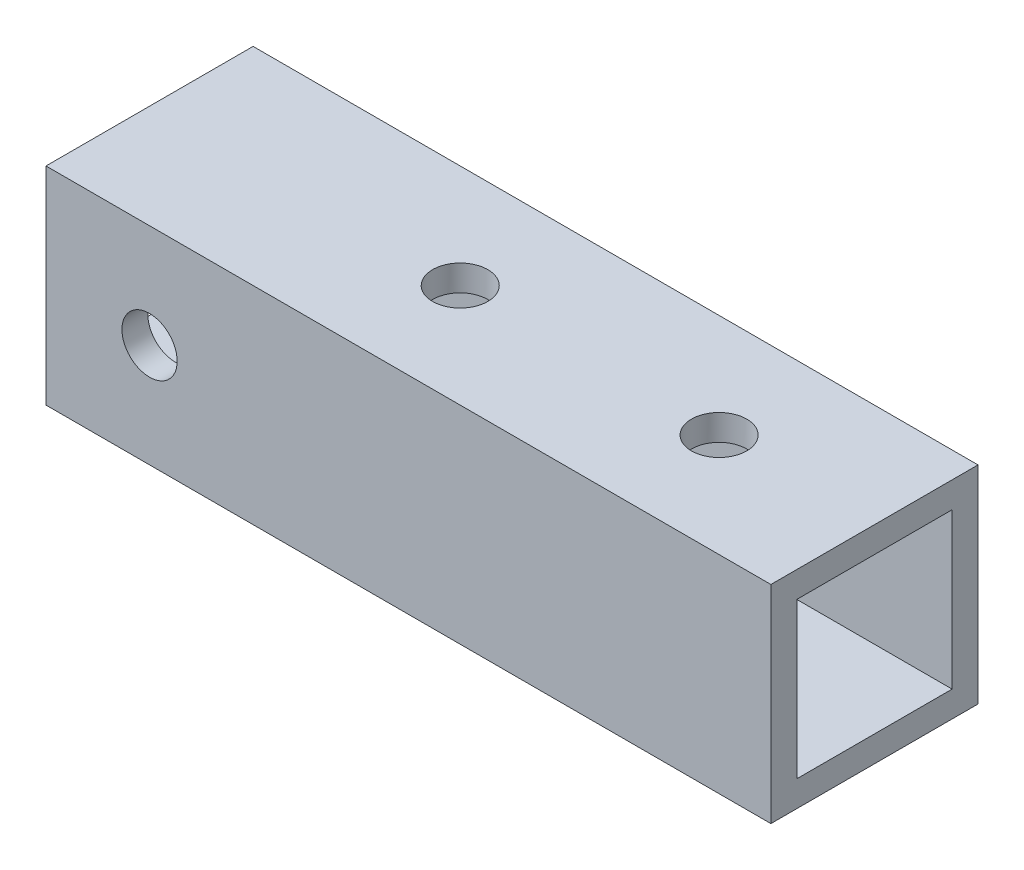
ISO-10303-21;
HEADER;
FILE_DESCRIPTION(('STEP AP214'),'2;1');
FILE_NAME('part.step','',(''),(''),'','','');
FILE_SCHEMA(('AUTOMOTIVE_DESIGN { 1 0 10303 214 1 1 1 1 }'));
ENDSEC;
DATA;
#1=APPLICATION_CONTEXT('core data for automotive mechanical design processes');
#2=APPLICATION_PROTOCOL_DEFINITION('international standard','automotive_design',2000,#1);
#3=PRODUCT_CONTEXT('',#1,'mechanical');
#4=PRODUCT('Part','Part','',(#3));
#5=PRODUCT_RELATED_PRODUCT_CATEGORY('part','',(#4));
#6=PRODUCT_DEFINITION_FORMATION('','',#4);
#7=PRODUCT_DEFINITION_CONTEXT('part definition',#1,'design');
#8=PRODUCT_DEFINITION('design','',#6,#7);
#9=PRODUCT_DEFINITION_SHAPE('','',#8);
#10=(LENGTH_UNIT() NAMED_UNIT(*) SI_UNIT(.MILLI.,.METRE.));
#11=(NAMED_UNIT(*) PLANE_ANGLE_UNIT() SI_UNIT($,.RADIAN.));
#12=(NAMED_UNIT(*) SI_UNIT($,.STERADIAN.) SOLID_ANGLE_UNIT());
#13=UNCERTAINTY_MEASURE_WITH_UNIT(LENGTH_MEASURE(1.E-05),#10,'distance_accuracy_value','');
#14=(GEOMETRIC_REPRESENTATION_CONTEXT(3) GLOBAL_UNCERTAINTY_ASSIGNED_CONTEXT((#13)) GLOBAL_UNIT_ASSIGNED_CONTEXT((#10,
#11,#12)) REPRESENTATION_CONTEXT('',''));
#15=CARTESIAN_POINT('',(0.,0.,0.));
#16=DIRECTION('',(0.,0.,1.));
#17=DIRECTION('',(1.,0.,0.));
#18=AXIS2_PLACEMENT_3D('',#15,#16,#17);
#19=CARTESIAN_POINT('',(21.,0.,0.));
#20=DIRECTION('',(-1.,0.,0.));
#21=DIRECTION('',(0.,0.,1.));
#22=AXIS2_PLACEMENT_3D('',#19,#20,#21);
#23=PLANE('',#22);
#24=DIRECTION('',(0.,-1.,0.));
#25=VECTOR('',#24,1.);
#26=CARTESIAN_POINT('',(21.,6.,6.));
#27=LINE('',#26,#25);
#28=CARTESIAN_POINT('',(21.,6.,6.));
#29=VERTEX_POINT('',#28);
#30=CARTESIAN_POINT('',(21.,-6.,6.));
#31=VERTEX_POINT('',#30);
#32=EDGE_CURVE('E144',#29,#31,#27,.T.);
#33=ORIENTED_EDGE('',*,*,#32,.T.);
#34=DIRECTION('',(0.,0.,-1.));
#35=VECTOR('',#34,1.);
#36=CARTESIAN_POINT('',(21.,-6.,-6.));
#37=LINE('',#36,#35);
#38=CARTESIAN_POINT('',(21.,-6.,-6.));
#39=VERTEX_POINT('',#38);
#40=EDGE_CURVE('E147',#31,#39,#37,.T.);
#41=ORIENTED_EDGE('',*,*,#40,.T.);
#42=DIRECTION('',(0.,1.,0.));
#43=VECTOR('',#42,1.);
#44=CARTESIAN_POINT('',(21.,6.,-6.));
#45=LINE('',#44,#43);
#46=CARTESIAN_POINT('',(21.,6.,-6.));
#47=VERTEX_POINT('',#46);
#48=EDGE_CURVE('E150',#39,#47,#45,.T.);
#49=ORIENTED_EDGE('',*,*,#48,.T.);
#50=DIRECTION('',(0.,0.,1.));
#51=VECTOR('',#50,1.);
#52=CARTESIAN_POINT('',(21.,6.,-6.));
#53=LINE('',#52,#51);
#54=EDGE_CURVE('E152',#47,#29,#53,.T.);
#55=ORIENTED_EDGE('',*,*,#54,.T.);
#56=EDGE_LOOP('',(#33,#41,#49,#55));
#57=FACE_BOUND('',#56,.T.);
#58=DIRECTION('',(0.,0.,1.));
#59=VECTOR('',#58,1.);
#60=CARTESIAN_POINT('',(21.,4.5,-4.5));
#61=LINE('',#60,#59);
#62=CARTESIAN_POINT('',(21.,4.5,-4.5));
#63=VERTEX_POINT('',#62);
#64=CARTESIAN_POINT('',(21.,4.5,4.5));
#65=VERTEX_POINT('',#64);
#66=EDGE_CURVE('E106',#63,#65,#61,.T.);
#67=ORIENTED_EDGE('',*,*,#66,.F.);
#68=DIRECTION('',(0.,1.,0.));
#69=VECTOR('',#68,1.);
#70=CARTESIAN_POINT('',(21.,4.5,-4.5));
#71=LINE('',#70,#69);
#72=CARTESIAN_POINT('',(21.,-4.5,-4.5));
#73=VERTEX_POINT('',#72);
#74=EDGE_CURVE('E128',#73,#63,#71,.T.);
#75=ORIENTED_EDGE('',*,*,#74,.F.);
#76=DIRECTION('',(0.,0.,-1.));
#77=VECTOR('',#76,1.);
#78=CARTESIAN_POINT('',(21.,-4.5,-4.5));
#79=LINE('',#78,#77);
#80=CARTESIAN_POINT('',(21.,-4.5,4.5));
#81=VERTEX_POINT('',#80);
#82=EDGE_CURVE('E126',#81,#73,#79,.T.);
#83=ORIENTED_EDGE('',*,*,#82,.F.);
#84=DIRECTION('',(0.,-1.,0.));
#85=VECTOR('',#84,1.);
#86=CARTESIAN_POINT('',(21.,4.5,4.5));
#87=LINE('',#86,#85);
#88=EDGE_CURVE('E114',#65,#81,#87,.T.);
#89=ORIENTED_EDGE('',*,*,#88,.F.);
#90=EDGE_LOOP('',(#67,#75,#83,#89));
#91=FACE_BOUND('',#90,.T.);
#92=ADVANCED_FACE('F39',(#57,#91),#23,.F.);
#93=CARTESIAN_POINT('',(-21.,0.,0.));
#94=DIRECTION('',(-1.,0.,0.));
#95=DIRECTION('',(0.,0.,1.));
#96=AXIS2_PLACEMENT_3D('',#93,#94,#95);
#97=PLANE('',#96);
#98=DIRECTION('',(0.,-1.,0.));
#99=VECTOR('',#98,1.);
#100=CARTESIAN_POINT('',(-21.,6.,6.));
#101=LINE('',#100,#99);
#102=CARTESIAN_POINT('',(-21.,6.,6.));
#103=VERTEX_POINT('',#102);
#104=CARTESIAN_POINT('',(-21.,-6.,6.));
#105=VERTEX_POINT('',#104);
#106=EDGE_CURVE('E122',#103,#105,#101,.T.);
#107=ORIENTED_EDGE('',*,*,#106,.F.);
#108=DIRECTION('',(0.,0.,1.));
#109=VECTOR('',#108,1.);
#110=CARTESIAN_POINT('',(-21.,6.,-6.));
#111=LINE('',#110,#109);
#112=CARTESIAN_POINT('',(-21.,6.,-6.));
#113=VERTEX_POINT('',#112);
#114=EDGE_CURVE('E148',#113,#103,#111,.T.);
#115=ORIENTED_EDGE('',*,*,#114,.F.);
#116=DIRECTION('',(0.,1.,0.));
#117=VECTOR('',#116,1.);
#118=CARTESIAN_POINT('',(-21.,6.,-6.));
#119=LINE('',#118,#117);
#120=CARTESIAN_POINT('',(-21.,-6.,-6.));
#121=VERTEX_POINT('',#120);
#122=EDGE_CURVE('E159',#121,#113,#119,.T.);
#123=ORIENTED_EDGE('',*,*,#122,.F.);
#124=DIRECTION('',(0.,0.,-1.));
#125=VECTOR('',#124,1.);
#126=CARTESIAN_POINT('',(-21.,-6.,-6.));
#127=LINE('',#126,#125);
#128=EDGE_CURVE('E157',#105,#121,#127,.T.);
#129=ORIENTED_EDGE('',*,*,#128,.F.);
#130=EDGE_LOOP('',(#107,#115,#123,#129));
#131=FACE_BOUND('',#130,.T.);
#132=DIRECTION('',(0.,1.,0.));
#133=VECTOR('',#132,1.);
#134=CARTESIAN_POINT('',(-21.,4.5,-4.5));
#135=LINE('',#134,#133);
#136=CARTESIAN_POINT('',(-21.,-4.5,-4.5));
#137=VERTEX_POINT('',#136);
#138=CARTESIAN_POINT('',(-21.,4.5,-4.5));
#139=VERTEX_POINT('',#138);
#140=EDGE_CURVE('E115',#137,#139,#135,.T.);
#141=ORIENTED_EDGE('',*,*,#140,.T.);
#142=DIRECTION('',(0.,0.,1.));
#143=VECTOR('',#142,1.);
#144=CARTESIAN_POINT('',(-21.,4.5,-4.5));
#145=LINE('',#144,#143);
#146=CARTESIAN_POINT('',(-21.,4.5,4.5));
#147=VERTEX_POINT('',#146);
#148=EDGE_CURVE('E64',#139,#147,#145,.T.);
#149=ORIENTED_EDGE('',*,*,#148,.T.);
#150=DIRECTION('',(0.,-1.,0.));
#151=VECTOR('',#150,1.);
#152=CARTESIAN_POINT('',(-21.,4.5,4.5));
#153=LINE('',#152,#151);
#154=CARTESIAN_POINT('',(-21.,-4.5,4.5));
#155=VERTEX_POINT('',#154);
#156=EDGE_CURVE('E121',#147,#155,#153,.T.);
#157=ORIENTED_EDGE('',*,*,#156,.T.);
#158=DIRECTION('',(0.,0.,-1.));
#159=VECTOR('',#158,1.);
#160=CARTESIAN_POINT('',(-21.,-4.5,-4.5));
#161=LINE('',#160,#159);
#162=EDGE_CURVE('E136',#155,#137,#161,.T.);
#163=ORIENTED_EDGE('',*,*,#162,.T.);
#164=EDGE_LOOP('',(#141,#149,#157,#163));
#165=FACE_BOUND('',#164,.T.);
#166=ADVANCED_FACE('F217',(#131,#165),#97,.T.);
#167=CARTESIAN_POINT('',(21.,6.,6.));
#168=DIRECTION('',(0.,0.,-1.));
#169=DIRECTION('',(0.,1.,0.));
#170=AXIS2_PLACEMENT_3D('',#167,#168,#169);
#171=PLANE('',#170);
#172=CARTESIAN_POINT('',(-15.,0.,6.));
#173=DIRECTION('',(0.,0.,1.));
#174=DIRECTION('',(1.,0.,0.));
#175=AXIS2_PLACEMENT_3D('',#172,#173,#174);
#176=CIRCLE('',#175,1.60000000000002);
#177=CARTESIAN_POINT('',(-13.4,0.,6.));
#178=VERTEX_POINT('',#177);
#179=EDGE_CURVE('E197',#178,#178,#176,.T.);
#180=ORIENTED_EDGE('',*,*,#179,.F.);
#181=EDGE_LOOP('',(#180));
#182=FACE_BOUND('',#181,.T.);
#183=ORIENTED_EDGE('',*,*,#106,.T.);
#184=DIRECTION('',(-1.,0.,0.));
#185=VECTOR('',#184,1.);
#186=CARTESIAN_POINT('',(21.,-6.,6.));
#187=LINE('',#186,#185);
#188=EDGE_CURVE('E11',#31,#105,#187,.T.);
#189=ORIENTED_EDGE('',*,*,#188,.F.);
#190=ORIENTED_EDGE('',*,*,#32,.F.);
#191=DIRECTION('',(-1.,0.,0.));
#192=VECTOR('',#191,1.);
#193=CARTESIAN_POINT('',(21.,6.,6.));
#194=LINE('',#193,#192);
#195=EDGE_CURVE('E154',#29,#103,#194,.T.);
#196=ORIENTED_EDGE('',*,*,#195,.T.);
#197=EDGE_LOOP('',(#183,#189,#190,#196));
#198=FACE_BOUND('',#197,.T.);
#199=ADVANCED_FACE('F41',(#182,#198),#171,.F.);
#200=CARTESIAN_POINT('',(21.,-6.,-6.));
#201=DIRECTION('',(0.,1.,0.));
#202=DIRECTION('',(0.,0.,1.));
#203=AXIS2_PLACEMENT_3D('',#200,#201,#202);
#204=PLANE('',#203);
#205=CARTESIAN_POINT('',(-3.,-6.,0.));
#206=DIRECTION('',(0.,1.,0.));
#207=DIRECTION('',(0.,0.,1.));
#208=AXIS2_PLACEMENT_3D('',#205,#206,#207);
#209=CIRCLE('',#208,1.60000000000002);
#210=CARTESIAN_POINT('',(-3.,-6.,1.60000000000002));
#211=VERTEX_POINT('',#210);
#212=EDGE_CURVE('E172',#211,#211,#209,.T.);
#213=ORIENTED_EDGE('',*,*,#212,.T.);
#214=EDGE_LOOP('',(#213));
#215=FACE_BOUND('',#214,.T.);
#216=CARTESIAN_POINT('',(12.,-6.,0.));
#217=DIRECTION('',(0.,1.,0.));
#218=DIRECTION('',(0.,0.,1.));
#219=AXIS2_PLACEMENT_3D('',#216,#217,#218);
#220=CIRCLE('',#219,1.60000000000002);
#221=CARTESIAN_POINT('',(12.,-6.,1.60000000000002));
#222=VERTEX_POINT('',#221);
#223=EDGE_CURVE('E186',#222,#222,#220,.T.);
#224=ORIENTED_EDGE('',*,*,#223,.T.);
#225=EDGE_LOOP('',(#224));
#226=FACE_BOUND('',#225,.T.);
#227=ORIENTED_EDGE('',*,*,#128,.T.);
#228=DIRECTION('',(-1.,0.,0.));
#229=VECTOR('',#228,1.);
#230=CARTESIAN_POINT('',(21.,-6.,-6.));
#231=LINE('',#230,#229);
#232=EDGE_CURVE('E48',#39,#121,#231,.T.);
#233=ORIENTED_EDGE('',*,*,#232,.F.);
#234=ORIENTED_EDGE('',*,*,#40,.F.);
#235=ORIENTED_EDGE('',*,*,#188,.T.);
#236=EDGE_LOOP('',(#227,#233,#234,#235));
#237=FACE_BOUND('',#236,.T.);
#238=ADVANCED_FACE('F244',(#215,#226,#237),#204,.F.);
#239=CARTESIAN_POINT('',(21.,6.,-6.));
#240=DIRECTION('',(0.,0.,1.));
#241=DIRECTION('',(0.,-1.,0.));
#242=AXIS2_PLACEMENT_3D('',#239,#240,#241);
#243=PLANE('',#242);
#244=CARTESIAN_POINT('',(-15.,0.,-6.));
#245=DIRECTION('',(0.,0.,1.));
#246=DIRECTION('',(1.,0.,0.));
#247=AXIS2_PLACEMENT_3D('',#244,#245,#246);
#248=CIRCLE('',#247,1.60000000000002);
#249=CARTESIAN_POINT('',(-13.4,0.,-6.));
#250=VERTEX_POINT('',#249);
#251=EDGE_CURVE('E200',#250,#250,#248,.T.);
#252=ORIENTED_EDGE('',*,*,#251,.T.);
#253=EDGE_LOOP('',(#252));
#254=FACE_BOUND('',#253,.T.);
#255=ORIENTED_EDGE('',*,*,#122,.T.);
#256=DIRECTION('',(-1.,0.,0.));
#257=VECTOR('',#256,1.);
#258=CARTESIAN_POINT('',(21.,6.,-6.));
#259=LINE('',#258,#257);
#260=EDGE_CURVE('E164',#47,#113,#259,.T.);
#261=ORIENTED_EDGE('',*,*,#260,.F.);
#262=ORIENTED_EDGE('',*,*,#48,.F.);
#263=ORIENTED_EDGE('',*,*,#232,.T.);
#264=EDGE_LOOP('',(#255,#261,#262,#263));
#265=FACE_BOUND('',#264,.T.);
#266=ADVANCED_FACE('F241',(#254,#265),#243,.F.);
#267=CARTESIAN_POINT('',(21.,6.,-6.));
#268=DIRECTION('',(0.,-1.,0.));
#269=DIRECTION('',(0.,0.,-1.));
#270=AXIS2_PLACEMENT_3D('',#267,#268,#269);
#271=PLANE('',#270);
#272=CARTESIAN_POINT('',(-3.,6.,0.));
#273=DIRECTION('',(0.,1.,0.));
#274=DIRECTION('',(0.,0.,1.));
#275=AXIS2_PLACEMENT_3D('',#272,#273,#274);
#276=CIRCLE('',#275,1.60000000000002);
#277=CARTESIAN_POINT('',(-3.,6.,1.60000000000002));
#278=VERTEX_POINT('',#277);
#279=EDGE_CURVE('E190',#278,#278,#276,.T.);
#280=ORIENTED_EDGE('',*,*,#279,.F.);
#281=EDGE_LOOP('',(#280));
#282=FACE_BOUND('',#281,.T.);
#283=CARTESIAN_POINT('',(12.,6.,0.));
#284=DIRECTION('',(0.,1.,0.));
#285=DIRECTION('',(0.,0.,1.));
#286=AXIS2_PLACEMENT_3D('',#283,#284,#285);
#287=CIRCLE('',#286,1.60000000000002);
#288=CARTESIAN_POINT('',(12.,6.,1.60000000000002));
#289=VERTEX_POINT('',#288);
#290=EDGE_CURVE('E183',#289,#289,#287,.T.);
#291=ORIENTED_EDGE('',*,*,#290,.F.);
#292=EDGE_LOOP('',(#291));
#293=FACE_BOUND('',#292,.T.);
#294=ORIENTED_EDGE('',*,*,#114,.T.);
#295=ORIENTED_EDGE('',*,*,#195,.F.);
#296=ORIENTED_EDGE('',*,*,#54,.F.);
#297=ORIENTED_EDGE('',*,*,#260,.T.);
#298=EDGE_LOOP('',(#294,#295,#296,#297));
#299=FACE_BOUND('',#298,.T.);
#300=ADVANCED_FACE('F238',(#282,#293,#299),#271,.F.);
#301=CARTESIAN_POINT('',(21.,4.5,-4.5));
#302=DIRECTION('',(0.,-1.,0.));
#303=DIRECTION('',(0.,0.,-1.));
#304=AXIS2_PLACEMENT_3D('',#301,#302,#303);
#305=PLANE('',#304);
#306=CARTESIAN_POINT('',(-3.,4.5,0.));
#307=DIRECTION('',(0.,-1.,0.));
#308=DIRECTION('',(0.,0.,-1.));
#309=AXIS2_PLACEMENT_3D('',#306,#307,#308);
#310=CIRCLE('',#309,1.60000000000002);
#311=CARTESIAN_POINT('',(-3.,4.5,-1.60000000000002));
#312=VERTEX_POINT('',#311);
#313=EDGE_CURVE('E134',#312,#312,#310,.T.);
#314=ORIENTED_EDGE('',*,*,#313,.F.);
#315=EDGE_LOOP('',(#314));
#316=FACE_BOUND('',#315,.T.);
#317=CARTESIAN_POINT('',(12.,4.5,0.));
#318=DIRECTION('',(0.,-1.,0.));
#319=DIRECTION('',(0.,0.,-1.));
#320=AXIS2_PLACEMENT_3D('',#317,#318,#319);
#321=CIRCLE('',#320,1.60000000000002);
#322=CARTESIAN_POINT('',(12.,4.5,-1.60000000000002));
#323=VERTEX_POINT('',#322);
#324=EDGE_CURVE('E171',#323,#323,#321,.T.);
#325=ORIENTED_EDGE('',*,*,#324,.F.);
#326=EDGE_LOOP('',(#325));
#327=FACE_BOUND('',#326,.T.);
#328=ORIENTED_EDGE('',*,*,#148,.F.);
#329=DIRECTION('',(-1.,0.,0.));
#330=VECTOR('',#329,1.);
#331=CARTESIAN_POINT('',(21.,4.5,-4.5));
#332=LINE('',#331,#330);
#333=EDGE_CURVE('E110',#63,#139,#332,.T.);
#334=ORIENTED_EDGE('',*,*,#333,.F.);
#335=ORIENTED_EDGE('',*,*,#66,.T.);
#336=DIRECTION('',(-1.,0.,0.));
#337=VECTOR('',#336,1.);
#338=CARTESIAN_POINT('',(21.,4.5,4.5));
#339=LINE('',#338,#337);
#340=EDGE_CURVE('E109',#65,#147,#339,.T.);
#341=ORIENTED_EDGE('',*,*,#340,.T.);
#342=EDGE_LOOP('',(#328,#334,#335,#341));
#343=FACE_BOUND('',#342,.T.);
#344=ADVANCED_FACE('F108',(#316,#327,#343),#305,.T.);
#345=CARTESIAN_POINT('',(21.,4.5,4.5));
#346=DIRECTION('',(0.,0.,-1.));
#347=DIRECTION('',(0.,1.,0.));
#348=AXIS2_PLACEMENT_3D('',#345,#346,#347);
#349=PLANE('',#348);
#350=CARTESIAN_POINT('',(-15.,0.,4.5));
#351=DIRECTION('',(0.,0.,-1.));
#352=DIRECTION('',(0.,1.,0.));
#353=AXIS2_PLACEMENT_3D('',#350,#351,#352);
#354=CIRCLE('',#353,1.60000000000002);
#355=CARTESIAN_POINT('',(-15.,1.60000000000002,4.5));
#356=VERTEX_POINT('',#355);
#357=EDGE_CURVE('E187',#356,#356,#354,.T.);
#358=ORIENTED_EDGE('',*,*,#357,.F.);
#359=EDGE_LOOP('',(#358));
#360=FACE_BOUND('',#359,.T.);
#361=ORIENTED_EDGE('',*,*,#156,.F.);
#362=ORIENTED_EDGE('',*,*,#340,.F.);
#363=ORIENTED_EDGE('',*,*,#88,.T.);
#364=DIRECTION('',(-1.,0.,0.));
#365=VECTOR('',#364,1.);
#366=CARTESIAN_POINT('',(21.,-4.5,4.5));
#367=LINE('',#366,#365);
#368=EDGE_CURVE('E123',#81,#155,#367,.T.);
#369=ORIENTED_EDGE('',*,*,#368,.T.);
#370=EDGE_LOOP('',(#361,#362,#363,#369));
#371=FACE_BOUND('',#370,.T.);
#372=ADVANCED_FACE('F118',(#360,#371),#349,.T.);
#373=CARTESIAN_POINT('',(21.,-4.5,-4.5));
#374=DIRECTION('',(0.,1.,0.));
#375=DIRECTION('',(0.,0.,1.));
#376=AXIS2_PLACEMENT_3D('',#373,#374,#375);
#377=PLANE('',#376);
#378=CARTESIAN_POINT('',(-3.,-4.5,0.));
#379=DIRECTION('',(0.,1.,0.));
#380=DIRECTION('',(0.,0.,1.));
#381=AXIS2_PLACEMENT_3D('',#378,#379,#380);
#382=CIRCLE('',#381,1.60000000000002);
#383=CARTESIAN_POINT('',(-3.,-4.5,1.60000000000002));
#384=VERTEX_POINT('',#383);
#385=EDGE_CURVE('E173',#384,#384,#382,.T.);
#386=ORIENTED_EDGE('',*,*,#385,.F.);
#387=EDGE_LOOP('',(#386));
#388=FACE_BOUND('',#387,.T.);
#389=CARTESIAN_POINT('',(12.,-4.5,0.));
#390=DIRECTION('',(0.,1.,0.));
#391=DIRECTION('',(0.,0.,1.));
#392=AXIS2_PLACEMENT_3D('',#389,#390,#391);
#393=CIRCLE('',#392,1.60000000000002);
#394=CARTESIAN_POINT('',(12.,-4.5,1.60000000000002));
#395=VERTEX_POINT('',#394);
#396=EDGE_CURVE('E169',#395,#395,#393,.T.);
#397=ORIENTED_EDGE('',*,*,#396,.F.);
#398=EDGE_LOOP('',(#397));
#399=FACE_BOUND('',#398,.T.);
#400=ORIENTED_EDGE('',*,*,#162,.F.);
#401=ORIENTED_EDGE('',*,*,#368,.F.);
#402=ORIENTED_EDGE('',*,*,#82,.T.);
#403=DIRECTION('',(-1.,0.,0.));
#404=VECTOR('',#403,1.);
#405=CARTESIAN_POINT('',(21.,-4.5,-4.5));
#406=LINE('',#405,#404);
#407=EDGE_CURVE('E56',#73,#137,#406,.T.);
#408=ORIENTED_EDGE('',*,*,#407,.T.);
#409=EDGE_LOOP('',(#400,#401,#402,#408));
#410=FACE_BOUND('',#409,.T.);
#411=ADVANCED_FACE('F213',(#388,#399,#410),#377,.T.);
#412=CARTESIAN_POINT('',(21.,4.5,-4.5));
#413=DIRECTION('',(0.,0.,1.));
#414=DIRECTION('',(0.,-1.,0.));
#415=AXIS2_PLACEMENT_3D('',#412,#413,#414);
#416=PLANE('',#415);
#417=CARTESIAN_POINT('',(-15.,0.,-4.5));
#418=DIRECTION('',(0.,0.,1.));
#419=DIRECTION('',(0.,-1.,0.));
#420=AXIS2_PLACEMENT_3D('',#417,#418,#419);
#421=CIRCLE('',#420,1.60000000000002);
#422=CARTESIAN_POINT('',(-15.,-1.60000000000002,-4.5));
#423=VERTEX_POINT('',#422);
#424=EDGE_CURVE('E43',#423,#423,#421,.T.);
#425=ORIENTED_EDGE('',*,*,#424,.F.);
#426=EDGE_LOOP('',(#425));
#427=FACE_BOUND('',#426,.T.);
#428=ORIENTED_EDGE('',*,*,#140,.F.);
#429=ORIENTED_EDGE('',*,*,#407,.F.);
#430=ORIENTED_EDGE('',*,*,#74,.T.);
#431=ORIENTED_EDGE('',*,*,#333,.T.);
#432=EDGE_LOOP('',(#428,#429,#430,#431));
#433=FACE_BOUND('',#432,.T.);
#434=ADVANCED_FACE('F210',(#427,#433),#416,.T.);
#435=CARTESIAN_POINT('',(12.,-6.,0.));
#436=DIRECTION('',(0.,1.,0.));
#437=DIRECTION('',(0.,0.,1.));
#438=AXIS2_PLACEMENT_3D('',#435,#436,#437);
#439=CYLINDRICAL_SURFACE('',#438,1.60000000000002);
#440=ORIENTED_EDGE('',*,*,#396,.T.);
#441=EDGE_LOOP('',(#440));
#442=FACE_BOUND('',#441,.T.);
#443=ORIENTED_EDGE('',*,*,#223,.F.);
#444=EDGE_LOOP('',(#443));
#445=FACE_BOUND('',#444,.T.);
#446=ADVANCED_FACE('F212',(#442,#445),#439,.F.);
#447=CARTESIAN_POINT('',(-3.,-6.,0.));
#448=DIRECTION('',(0.,1.,0.));
#449=DIRECTION('',(0.,0.,1.));
#450=AXIS2_PLACEMENT_3D('',#447,#448,#449);
#451=CYLINDRICAL_SURFACE('',#450,1.60000000000002);
#452=ORIENTED_EDGE('',*,*,#385,.T.);
#453=EDGE_LOOP('',(#452));
#454=FACE_BOUND('',#453,.T.);
#455=ORIENTED_EDGE('',*,*,#212,.F.);
#456=EDGE_LOOP('',(#455));
#457=FACE_BOUND('',#456,.T.);
#458=ADVANCED_FACE('F270',(#454,#457),#451,.F.);
#459=ORIENTED_EDGE('',*,*,#324,.T.);
#460=EDGE_LOOP('',(#459));
#461=FACE_BOUND('',#460,.T.);
#462=ORIENTED_EDGE('',*,*,#290,.T.);
#463=EDGE_LOOP('',(#462));
#464=FACE_BOUND('',#463,.T.);
#465=ADVANCED_FACE('F273',(#461,#464),#439,.F.);
#466=ORIENTED_EDGE('',*,*,#313,.T.);
#467=EDGE_LOOP('',(#466));
#468=FACE_BOUND('',#467,.T.);
#469=ORIENTED_EDGE('',*,*,#279,.T.);
#470=EDGE_LOOP('',(#469));
#471=FACE_BOUND('',#470,.T.);
#472=ADVANCED_FACE('F278',(#468,#471),#451,.F.);
#473=CARTESIAN_POINT('',(-15.,0.,-6.));
#474=DIRECTION('',(0.,0.,1.));
#475=DIRECTION('',(1.,0.,0.));
#476=AXIS2_PLACEMENT_3D('',#473,#474,#475);
#477=CYLINDRICAL_SURFACE('',#476,1.60000000000002);
#478=ORIENTED_EDGE('',*,*,#424,.T.);
#479=EDGE_LOOP('',(#478));
#480=FACE_BOUND('',#479,.T.);
#481=ORIENTED_EDGE('',*,*,#251,.F.);
#482=EDGE_LOOP('',(#481));
#483=FACE_BOUND('',#482,.T.);
#484=ADVANCED_FACE('F207',(#480,#483),#477,.F.);
#485=ORIENTED_EDGE('',*,*,#357,.T.);
#486=EDGE_LOOP('',(#485));
#487=FACE_BOUND('',#486,.T.);
#488=ORIENTED_EDGE('',*,*,#179,.T.);
#489=EDGE_LOOP('',(#488));
#490=FACE_BOUND('',#489,.T.);
#491=ADVANCED_FACE('F290',(#487,#490),#477,.F.);
#492=CLOSED_SHELL('',(#92,#166,#199,#238,#266,#300,#344,#372,#411,#434,#446,#458,#465,#472,#484,#491));
#493=MANIFOLD_SOLID_BREP('B2',#492);
#494=ADVANCED_BREP_SHAPE_REPRESENTATION('',(#18,#493),#14);
#495=SHAPE_DEFINITION_REPRESENTATION(#9,#494);
ENDSEC;
END-ISO-10303-21;
